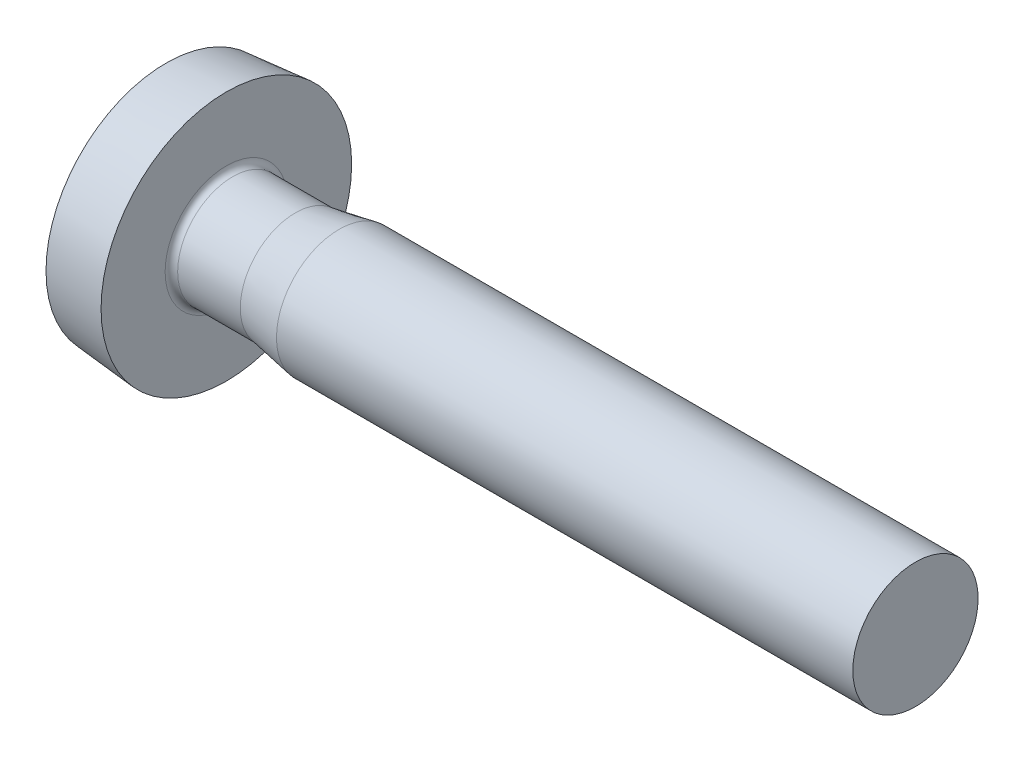
ISO-10303-21;
HEADER;
FILE_DESCRIPTION(('STEP AP214'),'2;1');
FILE_NAME('part.step','',(''),(''),'','','');
FILE_SCHEMA(('AUTOMOTIVE_DESIGN { 1 0 10303 214 1 1 1 1 }'));
ENDSEC;
DATA;
#1=APPLICATION_CONTEXT('core data for automotive mechanical design processes');
#2=APPLICATION_PROTOCOL_DEFINITION('international standard','automotive_design',2000,#1);
#3=PRODUCT_CONTEXT('',#1,'mechanical');
#4=PRODUCT('Part','Part','',(#3));
#5=PRODUCT_RELATED_PRODUCT_CATEGORY('part','',(#4));
#6=PRODUCT_DEFINITION_FORMATION('','',#4);
#7=PRODUCT_DEFINITION_CONTEXT('part definition',#1,'design');
#8=PRODUCT_DEFINITION('design','',#6,#7);
#9=PRODUCT_DEFINITION_SHAPE('','',#8);
#10=(LENGTH_UNIT() NAMED_UNIT(*) SI_UNIT(.MILLI.,.METRE.));
#11=(NAMED_UNIT(*) PLANE_ANGLE_UNIT() SI_UNIT($,.RADIAN.));
#12=(NAMED_UNIT(*) SI_UNIT($,.STERADIAN.) SOLID_ANGLE_UNIT());
#13=UNCERTAINTY_MEASURE_WITH_UNIT(LENGTH_MEASURE(1.E-05),#10,'distance_accuracy_value','');
#14=(GEOMETRIC_REPRESENTATION_CONTEXT(3) GLOBAL_UNCERTAINTY_ASSIGNED_CONTEXT((#13)) GLOBAL_UNIT_ASSIGNED_CONTEXT((#10,
#11,#12)) REPRESENTATION_CONTEXT('',''));
#15=CARTESIAN_POINT('',(0.,0.,0.));
#16=DIRECTION('',(0.,0.,1.));
#17=DIRECTION('',(1.,0.,0.));
#18=AXIS2_PLACEMENT_3D('',#15,#16,#17);
#19=CARTESIAN_POINT('',(1.59999999999987,0.,0.));
#20=DIRECTION('',(-1.,0.,0.));
#21=DIRECTION('',(0.,1.,0.));
#22=AXIS2_PLACEMENT_3D('',#19,#20,#21);
#23=SPHERICAL_SURFACE('',#22,3.19999999999987);
#24=CARTESIAN_POINT('',(-0.963195993658201,0.,0.));
#25=DIRECTION('',(-1.,0.,0.));
#26=DIRECTION('',(0.,0.,1.));
#27=AXIS2_PLACEMENT_3D('',#24,#25,#26);
#28=CIRCLE('',#27,1.9157312698013);
#29=CARTESIAN_POINT('',(-0.963195993658201,0.,1.9157312698013));
#30=VERTEX_POINT('',#29);
#31=EDGE_CURVE('E211',#30,#30,#28,.T.);
#32=ORIENTED_EDGE('',*,*,#31,.T.);
#33=EDGE_LOOP('',(#32));
#34=FACE_BOUND('',#33,.T.);
#35=CARTESIAN_POINT('',(1.59999999999987,0.153213036278402,-0.0134044037787443));
#36=DIRECTION('',(0.,-0.996194698091745,0.0871557427476639));
#37=DIRECTION('',(0.,-0.0871557427476639,-0.996194698091745));
#38=AXIS2_PLACEMENT_3D('',#35,#36,#37);
#39=CIRCLE('',#38,3.19630193934692);
#40=CARTESIAN_POINT('',(-1.44648875756993,0.2375,0.95));
#41=VERTEX_POINT('',#40);
#42=CARTESIAN_POINT('',(-1.57181248414002,0.18763146179022,0.38));
#43=VERTEX_POINT('',#42);
#44=EDGE_CURVE('E11',#41,#43,#39,.T.);
#45=ORIENTED_EDGE('',*,*,#44,.F.);
#46=CARTESIAN_POINT('',(1.59999999999987,0.,0.95));
#47=DIRECTION('',(0.,0.,-1.));
#48=DIRECTION('',(-1.,0.,0.));
#49=AXIS2_PLACEMENT_3D('',#46,#47,#48);
#50=CIRCLE('',#49,3.05573231811937);
#51=CARTESIAN_POINT('',(-1.44648875756992,-0.2375,0.95));
#52=VERTEX_POINT('',#51);
#53=EDGE_CURVE('E43',#52,#41,#50,.T.);
#54=ORIENTED_EDGE('',*,*,#53,.F.);
#55=CARTESIAN_POINT('',(1.59999999999987,-0.153213036278402,-0.0134044037787501));
#56=DIRECTION('',(0.,0.996194698091745,0.0871557427476639));
#57=DIRECTION('',(0.,-0.0871557427476639,0.996194698091745));
#58=AXIS2_PLACEMENT_3D('',#55,#56,#57);
#59=CIRCLE('',#58,3.19630193934691);
#60=CARTESIAN_POINT('',(-1.57181248414001,-0.18763146179022,0.38));
#61=VERTEX_POINT('',#60);
#62=EDGE_CURVE('E248',#61,#52,#59,.T.);
#63=ORIENTED_EDGE('',*,*,#62,.F.);
#64=CARTESIAN_POINT('',(1.59999999999987,-0.285633226163518,0.0999586768625951));
#65=DIRECTION('',(0.,0.943871701028256,-0.330312294651632));
#66=DIRECTION('',(0.,0.330312294651632,0.943871701028256));
#67=AXIS2_PLACEMENT_3D('',#64,#65,#66);
#68=CIRCLE('',#67,3.18565878948616);
#69=CARTESIAN_POINT('',(-1.58232422923875,-0.2375,0.2375));
#70=VERTEX_POINT('',#69);
#71=EDGE_CURVE('E246',#70,#61,#68,.T.);
#72=ORIENTED_EDGE('',*,*,#71,.F.);
#73=CARTESIAN_POINT('',(1.59999999999987,-0.0999586768625553,0.285633226163532));
#74=DIRECTION('',(0.,0.330312294651632,-0.943871701028256));
#75=DIRECTION('',(0.,0.943871701028256,0.330312294651632));
#76=AXIS2_PLACEMENT_3D('',#73,#74,#75);
#77=CIRCLE('',#76,3.18565878948616);
#78=CARTESIAN_POINT('',(-1.57181248414001,-0.38,0.18763146179022));
#79=VERTEX_POINT('',#78);
#80=EDGE_CURVE('E244',#79,#70,#77,.T.);
#81=ORIENTED_EDGE('',*,*,#80,.F.);
#82=CARTESIAN_POINT('',(1.59999999999987,0.01340440377878,0.153213036278399));
#83=DIRECTION('',(0.,-0.0871557427476639,-0.996194698091745));
#84=DIRECTION('',(0.,0.996194698091745,-0.0871557427476639));
#85=AXIS2_PLACEMENT_3D('',#82,#83,#84);
#86=CIRCLE('',#85,3.19630193934691);
#87=CARTESIAN_POINT('',(-1.44648875756992,-0.95,0.2375));
#88=VERTEX_POINT('',#87);
#89=EDGE_CURVE('E242',#88,#79,#86,.T.);
#90=ORIENTED_EDGE('',*,*,#89,.F.);
#91=CARTESIAN_POINT('',(1.59999999999987,-0.95,0.));
#92=DIRECTION('',(0.,1.,0.));
#93=DIRECTION('',(0.,0.,1.));
#94=AXIS2_PLACEMENT_3D('',#91,#92,#93);
#95=CIRCLE('',#94,3.05573231811936);
#96=CARTESIAN_POINT('',(-1.44648875756992,-0.95,-0.2375));
#97=VERTEX_POINT('',#96);
#98=EDGE_CURVE('E240',#97,#88,#95,.T.);
#99=ORIENTED_EDGE('',*,*,#98,.F.);
#100=CARTESIAN_POINT('',(1.59999999999987,0.01340440377878,-0.153213036278399));
#101=DIRECTION('',(0.,-0.0871557427476639,0.996194698091745));
#102=DIRECTION('',(0.,-0.996194698091745,-0.0871557427476639));
#103=AXIS2_PLACEMENT_3D('',#100,#101,#102);
#104=CIRCLE('',#103,3.19630193934691);
#105=CARTESIAN_POINT('',(-1.57181248414001,-0.38,-0.18763146179022));
#106=VERTEX_POINT('',#105);
#107=EDGE_CURVE('E238',#106,#97,#104,.T.);
#108=ORIENTED_EDGE('',*,*,#107,.F.);
#109=CARTESIAN_POINT('',(1.59999999999987,-0.0999586768625553,-0.285633226163532));
#110=DIRECTION('',(0.,0.330312294651632,0.943871701028256));
#111=DIRECTION('',(0.,-0.943871701028256,0.330312294651632));
#112=AXIS2_PLACEMENT_3D('',#109,#110,#111);
#113=CIRCLE('',#112,3.18565878948616);
#114=CARTESIAN_POINT('',(-1.58232422923875,-0.2375,-0.2375));
#115=VERTEX_POINT('',#114);
#116=EDGE_CURVE('E236',#115,#106,#113,.T.);
#117=ORIENTED_EDGE('',*,*,#116,.F.);
#118=CARTESIAN_POINT('',(1.59999999999987,-0.285633226163518,-0.0999586768625951));
#119=DIRECTION('',(0.,0.943871701028256,0.330312294651632));
#120=DIRECTION('',(0.,-0.330312294651632,0.943871701028256));
#121=AXIS2_PLACEMENT_3D('',#118,#119,#120);
#122=CIRCLE('',#121,3.18565878948616);
#123=CARTESIAN_POINT('',(-1.57181248414001,-0.18763146179022,-0.38));
#124=VERTEX_POINT('',#123);
#125=EDGE_CURVE('E234',#124,#115,#122,.T.);
#126=ORIENTED_EDGE('',*,*,#125,.F.);
#127=CARTESIAN_POINT('',(1.59999999999987,-0.153213036278402,0.0134044037787501));
#128=DIRECTION('',(0.,0.996194698091745,-0.0871557427476639));
#129=DIRECTION('',(0.,0.0871557427476639,0.996194698091745));
#130=AXIS2_PLACEMENT_3D('',#127,#128,#129);
#131=CIRCLE('',#130,3.19630193934691);
#132=CARTESIAN_POINT('',(-1.44648875756992,-0.2375,-0.95));
#133=VERTEX_POINT('',#132);
#134=EDGE_CURVE('E232',#133,#124,#131,.T.);
#135=ORIENTED_EDGE('',*,*,#134,.F.);
#136=CARTESIAN_POINT('',(1.59999999999987,0.,-0.95));
#137=DIRECTION('',(0.,0.,1.));
#138=DIRECTION('',(1.,0.,0.));
#139=AXIS2_PLACEMENT_3D('',#136,#137,#138);
#140=CIRCLE('',#139,3.05573231811937);
#141=CARTESIAN_POINT('',(-1.44648875756993,0.2375,-0.95));
#142=VERTEX_POINT('',#141);
#143=EDGE_CURVE('E230',#142,#133,#140,.T.);
#144=ORIENTED_EDGE('',*,*,#143,.F.);
#145=CARTESIAN_POINT('',(1.59999999999987,0.153213036278402,0.0134044037787443));
#146=DIRECTION('',(0.,-0.996194698091745,-0.0871557427476639));
#147=DIRECTION('',(0.,0.0871557427476639,-0.996194698091745));
#148=AXIS2_PLACEMENT_3D('',#145,#146,#147);
#149=CIRCLE('',#148,3.19630193934692);
#150=CARTESIAN_POINT('',(-1.57181248414002,0.18763146179022,-0.38));
#151=VERTEX_POINT('',#150);
#152=EDGE_CURVE('E228',#151,#142,#149,.T.);
#153=ORIENTED_EDGE('',*,*,#152,.F.);
#154=CARTESIAN_POINT('',(1.59999999999987,0.285633226163526,-0.0999586768625745));
#155=DIRECTION('',(0.,-0.943871701028256,0.330312294651632));
#156=DIRECTION('',(0.,-0.330312294651632,-0.943871701028256));
#157=AXIS2_PLACEMENT_3D('',#154,#155,#156);
#158=CIRCLE('',#157,3.18565878948617);
#159=CARTESIAN_POINT('',(-1.58232422923875,0.2375,-0.2375));
#160=VERTEX_POINT('',#159);
#161=EDGE_CURVE('E226',#160,#151,#158,.T.);
#162=ORIENTED_EDGE('',*,*,#161,.F.);
#163=CARTESIAN_POINT('',(1.59999999999987,0.0999586768626142,-0.285633226163512));
#164=DIRECTION('',(0.,-0.330312294651632,0.943871701028256));
#165=DIRECTION('',(0.,-0.943871701028256,-0.330312294651632));
#166=AXIS2_PLACEMENT_3D('',#163,#164,#165);
#167=CIRCLE('',#166,3.18565878948617);
#168=CARTESIAN_POINT('',(-1.57181248414002,0.38,-0.18763146179022));
#169=VERTEX_POINT('',#168);
#170=EDGE_CURVE('E224',#169,#160,#167,.T.);
#171=ORIENTED_EDGE('',*,*,#170,.F.);
#172=CARTESIAN_POINT('',(1.59999999999987,-0.0134044037787144,-0.153213036278405));
#173=DIRECTION('',(0.,0.0871557427476639,0.996194698091745));
#174=DIRECTION('',(0.,-0.996194698091745,0.0871557427476639));
#175=AXIS2_PLACEMENT_3D('',#172,#173,#174);
#176=CIRCLE('',#175,3.19630193934691);
#177=CARTESIAN_POINT('',(-1.44648875756994,0.95,-0.2375));
#178=VERTEX_POINT('',#177);
#179=EDGE_CURVE('E222',#178,#169,#176,.T.);
#180=ORIENTED_EDGE('',*,*,#179,.F.);
#181=CARTESIAN_POINT('',(1.59999999999987,0.95,0.));
#182=DIRECTION('',(0.,-1.,0.));
#183=DIRECTION('',(0.,0.,-1.));
#184=AXIS2_PLACEMENT_3D('',#181,#182,#183);
#185=CIRCLE('',#184,3.05573231811938);
#186=CARTESIAN_POINT('',(-1.44648875756994,0.95,0.2375));
#187=VERTEX_POINT('',#186);
#188=EDGE_CURVE('E220',#187,#178,#185,.T.);
#189=ORIENTED_EDGE('',*,*,#188,.F.);
#190=CARTESIAN_POINT('',(1.59999999999987,-0.0134044037787144,0.153213036278405));
#191=DIRECTION('',(0.,0.0871557427476639,-0.996194698091745));
#192=DIRECTION('',(0.,0.996194698091745,0.0871557427476639));
#193=AXIS2_PLACEMENT_3D('',#190,#191,#192);
#194=CIRCLE('',#193,3.19630193934691);
#195=CARTESIAN_POINT('',(-1.57181248414002,0.38,0.18763146179022));
#196=VERTEX_POINT('',#195);
#197=EDGE_CURVE('E218',#196,#187,#194,.T.);
#198=ORIENTED_EDGE('',*,*,#197,.F.);
#199=CARTESIAN_POINT('',(1.59999999999987,0.0999586768626142,0.285633226163512));
#200=DIRECTION('',(0.,-0.330312294651632,-0.943871701028256));
#201=DIRECTION('',(0.,0.943871701028256,-0.330312294651632));
#202=AXIS2_PLACEMENT_3D('',#199,#200,#201);
#203=CIRCLE('',#202,3.18565878948617);
#204=CARTESIAN_POINT('',(-1.58232422923875,0.2375,0.2375));
#205=VERTEX_POINT('',#204);
#206=EDGE_CURVE('E216',#205,#196,#203,.T.);
#207=ORIENTED_EDGE('',*,*,#206,.F.);
#208=CARTESIAN_POINT('',(1.59999999999987,0.285633226163526,0.0999586768625745));
#209=DIRECTION('',(0.,-0.943871701028256,-0.330312294651632));
#210=DIRECTION('',(0.,0.330312294651632,-0.943871701028256));
#211=AXIS2_PLACEMENT_3D('',#208,#209,#210);
#212=CIRCLE('',#211,3.18565878948617);
#213=EDGE_CURVE('E214',#43,#205,#212,.T.);
#214=ORIENTED_EDGE('',*,*,#213,.F.);
#215=EDGE_LOOP('',(#45,#54,#63,#72,#81,#90,#99,#108,#117,#126,#135,#144,#153,#162,#171,#180,
#189,#198,#207,#214));
#216=FACE_BOUND('',#215,.T.);
#217=ADVANCED_FACE('F36',(#34,#216),#23,.T.);
#218=CARTESIAN_POINT('',(11.,0.,0.));
#219=DIRECTION('',(-1.,0.,0.));
#220=DIRECTION('',(0.,0.,1.));
#221=AXIS2_PLACEMENT_3D('',#218,#219,#220);
#222=CYLINDRICAL_SURFACE('',#221,0.87725);
#223=CARTESIAN_POINT('',(0.1,0.,0.));
#224=DIRECTION('',(-1.,0.,0.));
#225=DIRECTION('',(0.,0.,1.));
#226=AXIS2_PLACEMENT_3D('',#223,#224,#225);
#227=CIRCLE('',#226,0.87725);
#228=CARTESIAN_POINT('',(0.1,0.,0.87725));
#229=VERTEX_POINT('',#228);
#230=EDGE_CURVE('E187',#229,#229,#227,.T.);
#231=ORIENTED_EDGE('',*,*,#230,.F.);
#232=EDGE_LOOP('',(#231));
#233=FACE_BOUND('',#232,.T.);
#234=CARTESIAN_POINT('',(1.1,0.,0.));
#235=DIRECTION('',(-1.,0.,0.));
#236=DIRECTION('',(0.,0.,1.));
#237=AXIS2_PLACEMENT_3D('',#234,#235,#236);
#238=CIRCLE('',#237,0.87725);
#239=CARTESIAN_POINT('',(1.1,0.,0.87725));
#240=VERTEX_POINT('',#239);
#241=EDGE_CURVE('E205',#240,#240,#238,.T.);
#242=ORIENTED_EDGE('',*,*,#241,.T.);
#243=EDGE_LOOP('',(#242));
#244=FACE_BOUND('',#243,.T.);
#245=ADVANCED_FACE('F428',(#233,#244),#222,.T.);
#246=CARTESIAN_POINT('',(1.8,0.,0.));
#247=DIRECTION('',(1.,0.,0.));
#248=DIRECTION('',(0.,0.,-1.));
#249=AXIS2_PLACEMENT_3D('',#246,#247,#248);
#250=CONICAL_SURFACE('',#249,1.,0.173592175789918);
#251=ORIENTED_EDGE('',*,*,#241,.F.);
#252=EDGE_LOOP('',(#251));
#253=FACE_BOUND('',#252,.T.);
#254=CARTESIAN_POINT('',(1.8,0.,0.));
#255=DIRECTION('',(-1.,0.,0.));
#256=DIRECTION('',(0.,0.,1.));
#257=AXIS2_PLACEMENT_3D('',#254,#255,#256);
#258=CIRCLE('',#257,1.);
#259=CARTESIAN_POINT('',(1.8,0.,1.));
#260=VERTEX_POINT('',#259);
#261=EDGE_CURVE('E202',#260,#260,#258,.T.);
#262=ORIENTED_EDGE('',*,*,#261,.T.);
#263=EDGE_LOOP('',(#262));
#264=FACE_BOUND('',#263,.T.);
#265=ADVANCED_FACE('F433',(#253,#264),#250,.T.);
#266=CARTESIAN_POINT('',(11.,0.,0.));
#267=DIRECTION('',(-1.,0.,0.));
#268=DIRECTION('',(0.,0.,1.));
#269=AXIS2_PLACEMENT_3D('',#266,#267,#268);
#270=CYLINDRICAL_SURFACE('',#269,1.);
#271=ORIENTED_EDGE('',*,*,#261,.F.);
#272=EDGE_LOOP('',(#271));
#273=FACE_BOUND('',#272,.T.);
#274=CARTESIAN_POINT('',(11.,0.,0.));
#275=DIRECTION('',(-1.,0.,0.));
#276=DIRECTION('',(0.,0.,1.));
#277=AXIS2_PLACEMENT_3D('',#274,#275,#276);
#278=CIRCLE('',#277,1.);
#279=CARTESIAN_POINT('',(11.,0.,1.));
#280=VERTEX_POINT('',#279);
#281=EDGE_CURVE('E199',#280,#280,#278,.T.);
#282=ORIENTED_EDGE('',*,*,#281,.T.);
#283=EDGE_LOOP('',(#282));
#284=FACE_BOUND('',#283,.T.);
#285=ADVANCED_FACE('F455',(#273,#284),#270,.T.);
#286=CARTESIAN_POINT('',(11.,1.,0.));
#287=DIRECTION('',(-1.,0.,0.));
#288=DIRECTION('',(0.,0.,1.));
#289=AXIS2_PLACEMENT_3D('',#286,#287,#288);
#290=PLANE('',#289);
#291=ORIENTED_EDGE('',*,*,#281,.F.);
#292=EDGE_LOOP('',(#291));
#293=FACE_BOUND('',#292,.T.);
#294=ADVANCED_FACE('F459',(#293),#290,.F.);
#295=CARTESIAN_POINT('',(0.100000000000008,0.,0.));
#296=DIRECTION('',(-1.,0.,0.));
#297=DIRECTION('',(0.,0.,1.));
#298=AXIS2_PLACEMENT_3D('',#295,#296,#297);
#299=TOROIDAL_SURFACE('',#298,0.977250000000008,0.100000000000008);
#300=CARTESIAN_POINT('',(0.,0.,0.));
#301=DIRECTION('',(-1.,0.,0.));
#302=DIRECTION('',(0.,0.,1.));
#303=AXIS2_PLACEMENT_3D('',#300,#301,#302);
#304=CIRCLE('',#303,0.977250000000008);
#305=CARTESIAN_POINT('',(0.,0.,0.977250000000008));
#306=VERTEX_POINT('',#305);
#307=EDGE_CURVE('E191',#306,#306,#304,.T.);
#308=ORIENTED_EDGE('',*,*,#307,.F.);
#309=EDGE_LOOP('',(#308));
#310=FACE_BOUND('',#309,.T.);
#311=ORIENTED_EDGE('',*,*,#230,.T.);
#312=EDGE_LOOP('',(#311));
#313=FACE_BOUND('',#312,.T.);
#314=ADVANCED_FACE('F442',(#310,#313),#299,.F.);
#315=CARTESIAN_POINT('',(0.,0.,0.));
#316=DIRECTION('',(1.,0.,0.));
#317=DIRECTION('',(0.,0.,-1.));
#318=AXIS2_PLACEMENT_3D('',#315,#316,#317);
#319=CONICAL_SURFACE('',#318,2.,0.0872664625997366);
#320=ORIENTED_EDGE('',*,*,#31,.F.);
#321=EDGE_LOOP('',(#320));
#322=FACE_BOUND('',#321,.T.);
#323=CARTESIAN_POINT('',(0.,0.,0.));
#324=DIRECTION('',(-1.,0.,0.));
#325=DIRECTION('',(0.,0.,1.));
#326=AXIS2_PLACEMENT_3D('',#323,#324,#325);
#327=CIRCLE('',#326,2.);
#328=CARTESIAN_POINT('',(0.,0.,2.));
#329=VERTEX_POINT('',#328);
#330=EDGE_CURVE('E208',#329,#329,#327,.T.);
#331=ORIENTED_EDGE('',*,*,#330,.T.);
#332=EDGE_LOOP('',(#331));
#333=FACE_BOUND('',#332,.T.);
#334=ADVANCED_FACE('F438',(#322,#333),#319,.T.);
#335=CARTESIAN_POINT('',(0.,2.,0.));
#336=DIRECTION('',(-1.,0.,0.));
#337=DIRECTION('',(0.,0.,1.));
#338=AXIS2_PLACEMENT_3D('',#335,#336,#337);
#339=PLANE('',#338);
#340=ORIENTED_EDGE('',*,*,#307,.T.);
#341=EDGE_LOOP('',(#340));
#342=FACE_BOUND('',#341,.T.);
#343=ORIENTED_EDGE('',*,*,#330,.F.);
#344=EDGE_LOOP('',(#343));
#345=FACE_BOUND('',#344,.T.);
#346=ADVANCED_FACE('F441',(#342,#345),#339,.F.);
#347=CARTESIAN_POINT('',(-0.8,0.18763146179022,0.38));
#348=DIRECTION('',(0.,-0.996194698091745,0.0871557427476639));
#349=DIRECTION('',(0.,-0.0871557427476639,-0.996194698091745));
#350=AXIS2_PLACEMENT_3D('',#347,#348,#349);
#351=PLANE('',#350);
#352=ORIENTED_EDGE('',*,*,#44,.T.);
#353=DIRECTION('',(-1.,0.,0.));
#354=VECTOR('',#353,1.);
#355=CARTESIAN_POINT('',(-0.8,0.18763146179022,0.38));
#356=LINE('',#355,#354);
#357=CARTESIAN_POINT('',(-0.8,0.18763146179022,0.38));
#358=VERTEX_POINT('',#357);
#359=EDGE_CURVE('E50',#358,#43,#356,.T.);
#360=ORIENTED_EDGE('',*,*,#359,.F.);
#361=DIRECTION('',(0.,0.0871557427476639,0.996194698091745));
#362=VECTOR('',#361,1.);
#363=CARTESIAN_POINT('',(-0.8,0.18763146179022,0.38));
#364=LINE('',#363,#362);
#365=CARTESIAN_POINT('',(-0.8,0.2375,0.95));
#366=VERTEX_POINT('',#365);
#367=EDGE_CURVE('E176',#358,#366,#364,.T.);
#368=ORIENTED_EDGE('',*,*,#367,.T.);
#369=DIRECTION('',(-1.,0.,0.));
#370=VECTOR('',#369,1.);
#371=CARTESIAN_POINT('',(-0.8,0.2375,0.95));
#372=LINE('',#371,#370);
#373=EDGE_CURVE('E183',#366,#41,#372,.T.);
#374=ORIENTED_EDGE('',*,*,#373,.T.);
#375=EDGE_LOOP('',(#352,#360,#368,#374));
#376=FACE_BOUND('',#375,.T.);
#377=ADVANCED_FACE('F182',(#376),#351,.T.);
#378=CARTESIAN_POINT('',(-0.8,0.2375,0.95));
#379=DIRECTION('',(0.,0.,-1.));
#380=DIRECTION('',(-1.,0.,0.));
#381=AXIS2_PLACEMENT_3D('',#378,#379,#380);
#382=PLANE('',#381);
#383=ORIENTED_EDGE('',*,*,#53,.T.);
#384=ORIENTED_EDGE('',*,*,#373,.F.);
#385=DIRECTION('',(0.,-1.,0.));
#386=VECTOR('',#385,1.);
#387=CARTESIAN_POINT('',(-0.8,0.2375,0.95));
#388=LINE('',#387,#386);
#389=CARTESIAN_POINT('',(-0.8,-0.2375,0.95));
#390=VERTEX_POINT('',#389);
#391=EDGE_CURVE('E172',#366,#390,#388,.T.);
#392=ORIENTED_EDGE('',*,*,#391,.T.);
#393=DIRECTION('',(-1.,0.,0.));
#394=VECTOR('',#393,1.);
#395=CARTESIAN_POINT('',(-0.8,-0.2375,0.95));
#396=LINE('',#395,#394);
#397=EDGE_CURVE('E188',#390,#52,#396,.T.);
#398=ORIENTED_EDGE('',*,*,#397,.T.);
#399=EDGE_LOOP('',(#383,#384,#392,#398));
#400=FACE_BOUND('',#399,.T.);
#401=ADVANCED_FACE('F186',(#400),#382,.T.);
#402=CARTESIAN_POINT('',(-0.8,-0.2375,0.95));
#403=DIRECTION('',(0.,0.996194698091745,0.0871557427476639));
#404=DIRECTION('',(0.,-0.0871557427476639,0.996194698091745));
#405=AXIS2_PLACEMENT_3D('',#402,#403,#404);
#406=PLANE('',#405);
#407=ORIENTED_EDGE('',*,*,#62,.T.);
#408=ORIENTED_EDGE('',*,*,#397,.F.);
#409=DIRECTION('',(0.,0.0871557427476639,-0.996194698091745));
#410=VECTOR('',#409,1.);
#411=CARTESIAN_POINT('',(-0.8,-0.2375,0.95));
#412=LINE('',#411,#410);
#413=CARTESIAN_POINT('',(-0.8,-0.18763146179022,0.38));
#414=VERTEX_POINT('',#413);
#415=EDGE_CURVE('E178',#390,#414,#412,.T.);
#416=ORIENTED_EDGE('',*,*,#415,.T.);
#417=DIRECTION('',(-1.,0.,0.));
#418=VECTOR('',#417,1.);
#419=CARTESIAN_POINT('',(-0.8,-0.18763146179022,0.38));
#420=LINE('',#419,#418);
#421=EDGE_CURVE('E193',#414,#61,#420,.T.);
#422=ORIENTED_EDGE('',*,*,#421,.T.);
#423=EDGE_LOOP('',(#407,#408,#416,#422));
#424=FACE_BOUND('',#423,.T.);
#425=ADVANCED_FACE('F252',(#424),#406,.T.);
#426=CARTESIAN_POINT('',(-0.8,-0.18763146179022,0.38));
#427=DIRECTION('',(0.,0.943871701028256,-0.330312294651632));
#428=DIRECTION('',(0.,0.330312294651632,0.943871701028256));
#429=AXIS2_PLACEMENT_3D('',#426,#427,#428);
#430=PLANE('',#429);
#431=ORIENTED_EDGE('',*,*,#71,.T.);
#432=ORIENTED_EDGE('',*,*,#421,.F.);
#433=DIRECTION('',(0.,-0.330312294651632,-0.943871701028256));
#434=VECTOR('',#433,1.);
#435=CARTESIAN_POINT('',(-0.8,-0.18763146179022,0.38));
#436=LINE('',#435,#434);
#437=CARTESIAN_POINT('',(-0.8,-0.2375,0.2375));
#438=VERTEX_POINT('',#437);
#439=EDGE_CURVE('E320',#414,#438,#436,.T.);
#440=ORIENTED_EDGE('',*,*,#439,.T.);
#441=DIRECTION('',(-1.,0.,0.));
#442=VECTOR('',#441,1.);
#443=CARTESIAN_POINT('',(-0.8,-0.2375,0.2375));
#444=LINE('',#443,#442);
#445=EDGE_CURVE('E315',#438,#70,#444,.T.);
#446=ORIENTED_EDGE('',*,*,#445,.T.);
#447=EDGE_LOOP('',(#431,#432,#440,#446));
#448=FACE_BOUND('',#447,.T.);
#449=ADVANCED_FACE('F319',(#448),#430,.T.);
#450=CARTESIAN_POINT('',(-0.8,-0.2375,0.2375));
#451=DIRECTION('',(0.,0.330312294651632,-0.943871701028256));
#452=DIRECTION('',(0.,0.943871701028256,0.330312294651632));
#453=AXIS2_PLACEMENT_3D('',#450,#451,#452);
#454=PLANE('',#453);
#455=ORIENTED_EDGE('',*,*,#80,.T.);
#456=ORIENTED_EDGE('',*,*,#445,.F.);
#457=DIRECTION('',(0.,-0.943871701028256,-0.330312294651632));
#458=VECTOR('',#457,1.);
#459=CARTESIAN_POINT('',(-0.8,-0.2375,0.2375));
#460=LINE('',#459,#458);
#461=CARTESIAN_POINT('',(-0.8,-0.38,0.18763146179022));
#462=VERTEX_POINT('',#461);
#463=EDGE_CURVE('E328',#438,#462,#460,.T.);
#464=ORIENTED_EDGE('',*,*,#463,.T.);
#465=DIRECTION('',(-1.,0.,0.));
#466=VECTOR('',#465,1.);
#467=CARTESIAN_POINT('',(-0.8,-0.38,0.18763146179022));
#468=LINE('',#467,#466);
#469=EDGE_CURVE('E312',#462,#79,#468,.T.);
#470=ORIENTED_EDGE('',*,*,#469,.T.);
#471=EDGE_LOOP('',(#455,#456,#464,#470));
#472=FACE_BOUND('',#471,.T.);
#473=ADVANCED_FACE('F326',(#472),#454,.T.);
#474=CARTESIAN_POINT('',(-0.8,-0.38,0.18763146179022));
#475=DIRECTION('',(0.,-0.0871557427476639,-0.996194698091745));
#476=DIRECTION('',(0.,0.996194698091745,-0.0871557427476639));
#477=AXIS2_PLACEMENT_3D('',#474,#475,#476);
#478=PLANE('',#477);
#479=ORIENTED_EDGE('',*,*,#89,.T.);
#480=ORIENTED_EDGE('',*,*,#469,.F.);
#481=DIRECTION('',(0.,-0.996194698091745,0.0871557427476639));
#482=VECTOR('',#481,1.);
#483=CARTESIAN_POINT('',(-0.8,-0.38,0.18763146179022));
#484=LINE('',#483,#482);
#485=CARTESIAN_POINT('',(-0.8,-0.95,0.2375));
#486=VERTEX_POINT('',#485);
#487=EDGE_CURVE('E332',#462,#486,#484,.T.);
#488=ORIENTED_EDGE('',*,*,#487,.T.);
#489=DIRECTION('',(-1.,0.,0.));
#490=VECTOR('',#489,1.);
#491=CARTESIAN_POINT('',(-0.8,-0.95,0.2375));
#492=LINE('',#491,#490);
#493=EDGE_CURVE('E309',#486,#88,#492,.T.);
#494=ORIENTED_EDGE('',*,*,#493,.T.);
#495=EDGE_LOOP('',(#479,#480,#488,#494));
#496=FACE_BOUND('',#495,.T.);
#497=ADVANCED_FACE('F331',(#496),#478,.T.);
#498=CARTESIAN_POINT('',(-0.8,-0.95,0.2375));
#499=DIRECTION('',(0.,1.,0.));
#500=DIRECTION('',(0.,0.,1.));
#501=AXIS2_PLACEMENT_3D('',#498,#499,#500);
#502=PLANE('',#501);
#503=ORIENTED_EDGE('',*,*,#98,.T.);
#504=ORIENTED_EDGE('',*,*,#493,.F.);
#505=DIRECTION('',(0.,0.,-1.));
#506=VECTOR('',#505,1.);
#507=CARTESIAN_POINT('',(-0.8,-0.95,0.2375));
#508=LINE('',#507,#506);
#509=CARTESIAN_POINT('',(-0.8,-0.95,-0.2375));
#510=VERTEX_POINT('',#509);
#511=EDGE_CURVE('E336',#486,#510,#508,.T.);
#512=ORIENTED_EDGE('',*,*,#511,.T.);
#513=DIRECTION('',(-1.,0.,0.));
#514=VECTOR('',#513,1.);
#515=CARTESIAN_POINT('',(-0.8,-0.95,-0.2375));
#516=LINE('',#515,#514);
#517=EDGE_CURVE('E306',#510,#97,#516,.T.);
#518=ORIENTED_EDGE('',*,*,#517,.T.);
#519=EDGE_LOOP('',(#503,#504,#512,#518));
#520=FACE_BOUND('',#519,.T.);
#521=ADVANCED_FACE('F418',(#520),#502,.T.);
#522=CARTESIAN_POINT('',(-0.8,-0.95,-0.2375));
#523=DIRECTION('',(0.,-0.0871557427476639,0.996194698091745));
#524=DIRECTION('',(0.,-0.996194698091745,-0.0871557427476639));
#525=AXIS2_PLACEMENT_3D('',#522,#523,#524);
#526=PLANE('',#525);
#527=ORIENTED_EDGE('',*,*,#107,.T.);
#528=ORIENTED_EDGE('',*,*,#517,.F.);
#529=DIRECTION('',(0.,0.996194698091745,0.0871557427476639));
#530=VECTOR('',#529,1.);
#531=CARTESIAN_POINT('',(-0.8,-0.95,-0.2375));
#532=LINE('',#531,#530);
#533=CARTESIAN_POINT('',(-0.8,-0.38,-0.18763146179022));
#534=VERTEX_POINT('',#533);
#535=EDGE_CURVE('E338',#510,#534,#532,.T.);
#536=ORIENTED_EDGE('',*,*,#535,.T.);
#537=DIRECTION('',(-1.,0.,0.));
#538=VECTOR('',#537,1.);
#539=CARTESIAN_POINT('',(-0.8,-0.38,-0.18763146179022));
#540=LINE('',#539,#538);
#541=EDGE_CURVE('E303',#534,#106,#540,.T.);
#542=ORIENTED_EDGE('',*,*,#541,.T.);
#543=EDGE_LOOP('',(#527,#528,#536,#542));
#544=FACE_BOUND('',#543,.T.);
#545=ADVANCED_FACE('F416',(#544),#526,.T.);
#546=CARTESIAN_POINT('',(-0.8,-0.38,-0.18763146179022));
#547=DIRECTION('',(0.,0.330312294651632,0.943871701028256));
#548=DIRECTION('',(0.,-0.943871701028256,0.330312294651632));
#549=AXIS2_PLACEMENT_3D('',#546,#547,#548);
#550=PLANE('',#549);
#551=ORIENTED_EDGE('',*,*,#116,.T.);
#552=ORIENTED_EDGE('',*,*,#541,.F.);
#553=DIRECTION('',(0.,0.943871701028256,-0.330312294651632));
#554=VECTOR('',#553,1.);
#555=CARTESIAN_POINT('',(-0.8,-0.38,-0.18763146179022));
#556=LINE('',#555,#554);
#557=CARTESIAN_POINT('',(-0.8,-0.2375,-0.2375));
#558=VERTEX_POINT('',#557);
#559=EDGE_CURVE('E344',#534,#558,#556,.T.);
#560=ORIENTED_EDGE('',*,*,#559,.T.);
#561=DIRECTION('',(-1.,0.,0.));
#562=VECTOR('',#561,1.);
#563=CARTESIAN_POINT('',(-0.8,-0.2375,-0.2375));
#564=LINE('',#563,#562);
#565=EDGE_CURVE('E300',#558,#115,#564,.T.);
#566=ORIENTED_EDGE('',*,*,#565,.T.);
#567=EDGE_LOOP('',(#551,#552,#560,#566));
#568=FACE_BOUND('',#567,.T.);
#569=ADVANCED_FACE('F411',(#568),#550,.T.);
#570=CARTESIAN_POINT('',(-0.8,-0.2375,-0.2375));
#571=DIRECTION('',(0.,0.943871701028256,0.330312294651632));
#572=DIRECTION('',(0.,-0.330312294651632,0.943871701028256));
#573=AXIS2_PLACEMENT_3D('',#570,#571,#572);
#574=PLANE('',#573);
#575=ORIENTED_EDGE('',*,*,#125,.T.);
#576=ORIENTED_EDGE('',*,*,#565,.F.);
#577=DIRECTION('',(0.,0.330312294651632,-0.943871701028256));
#578=VECTOR('',#577,1.);
#579=CARTESIAN_POINT('',(-0.8,-0.2375,-0.2375));
#580=LINE('',#579,#578);
#581=CARTESIAN_POINT('',(-0.8,-0.18763146179022,-0.38));
#582=VERTEX_POINT('',#581);
#583=EDGE_CURVE('E346',#558,#582,#580,.T.);
#584=ORIENTED_EDGE('',*,*,#583,.T.);
#585=DIRECTION('',(-1.,0.,0.));
#586=VECTOR('',#585,1.);
#587=CARTESIAN_POINT('',(-0.8,-0.18763146179022,-0.38));
#588=LINE('',#587,#586);
#589=EDGE_CURVE('E297',#582,#124,#588,.T.);
#590=ORIENTED_EDGE('',*,*,#589,.T.);
#591=EDGE_LOOP('',(#575,#576,#584,#590));
#592=FACE_BOUND('',#591,.T.);
#593=ADVANCED_FACE('F408',(#592),#574,.T.);
#594=CARTESIAN_POINT('',(-0.8,-0.18763146179022,-0.38));
#595=DIRECTION('',(0.,0.996194698091745,-0.0871557427476639));
#596=DIRECTION('',(0.,0.0871557427476639,0.996194698091745));
#597=AXIS2_PLACEMENT_3D('',#594,#595,#596);
#598=PLANE('',#597);
#599=ORIENTED_EDGE('',*,*,#134,.T.);
#600=ORIENTED_EDGE('',*,*,#589,.F.);
#601=DIRECTION('',(0.,-0.0871557427476639,-0.996194698091745));
#602=VECTOR('',#601,1.);
#603=CARTESIAN_POINT('',(-0.8,-0.18763146179022,-0.38));
#604=LINE('',#603,#602);
#605=CARTESIAN_POINT('',(-0.8,-0.2375,-0.95));
#606=VERTEX_POINT('',#605);
#607=EDGE_CURVE('E348',#582,#606,#604,.T.);
#608=ORIENTED_EDGE('',*,*,#607,.T.);
#609=DIRECTION('',(-1.,0.,0.));
#610=VECTOR('',#609,1.);
#611=CARTESIAN_POINT('',(-0.8,-0.2375,-0.95));
#612=LINE('',#611,#610);
#613=EDGE_CURVE('E294',#606,#133,#612,.T.);
#614=ORIENTED_EDGE('',*,*,#613,.T.);
#615=EDGE_LOOP('',(#599,#600,#608,#614));
#616=FACE_BOUND('',#615,.T.);
#617=ADVANCED_FACE('F401',(#616),#598,.T.);
#618=CARTESIAN_POINT('',(-0.8,-0.2375,-0.95));
#619=DIRECTION('',(0.,0.,1.));
#620=DIRECTION('',(1.,0.,0.));
#621=AXIS2_PLACEMENT_3D('',#618,#619,#620);
#622=PLANE('',#621);
#623=ORIENTED_EDGE('',*,*,#143,.T.);
#624=ORIENTED_EDGE('',*,*,#613,.F.);
#625=DIRECTION('',(0.,1.,0.));
#626=VECTOR('',#625,1.);
#627=CARTESIAN_POINT('',(-0.8,-0.2375,-0.95));
#628=LINE('',#627,#626);
#629=CARTESIAN_POINT('',(-0.8,0.2375,-0.95));
#630=VERTEX_POINT('',#629);
#631=EDGE_CURVE('E350',#606,#630,#628,.T.);
#632=ORIENTED_EDGE('',*,*,#631,.T.);
#633=DIRECTION('',(-1.,0.,0.));
#634=VECTOR('',#633,1.);
#635=CARTESIAN_POINT('',(-0.8,0.2375,-0.95));
#636=LINE('',#635,#634);
#637=EDGE_CURVE('E291',#630,#142,#636,.T.);
#638=ORIENTED_EDGE('',*,*,#637,.T.);
#639=EDGE_LOOP('',(#623,#624,#632,#638));
#640=FACE_BOUND('',#639,.T.);
#641=ADVANCED_FACE('F399',(#640),#622,.T.);
#642=CARTESIAN_POINT('',(-0.8,0.2375,-0.95));
#643=DIRECTION('',(0.,-0.996194698091745,-0.0871557427476639));
#644=DIRECTION('',(0.,0.0871557427476639,-0.996194698091745));
#645=AXIS2_PLACEMENT_3D('',#642,#643,#644);
#646=PLANE('',#645);
#647=ORIENTED_EDGE('',*,*,#152,.T.);
#648=ORIENTED_EDGE('',*,*,#637,.F.);
#649=DIRECTION('',(0.,-0.0871557427476639,0.996194698091745));
#650=VECTOR('',#649,1.);
#651=CARTESIAN_POINT('',(-0.8,0.2375,-0.95));
#652=LINE('',#651,#650);
#653=CARTESIAN_POINT('',(-0.8,0.18763146179022,-0.38));
#654=VERTEX_POINT('',#653);
#655=EDGE_CURVE('E352',#630,#654,#652,.T.);
#656=ORIENTED_EDGE('',*,*,#655,.T.);
#657=DIRECTION('',(-1.,0.,0.));
#658=VECTOR('',#657,1.);
#659=CARTESIAN_POINT('',(-0.8,0.18763146179022,-0.38));
#660=LINE('',#659,#658);
#661=EDGE_CURVE('E288',#654,#151,#660,.T.);
#662=ORIENTED_EDGE('',*,*,#661,.T.);
#663=EDGE_LOOP('',(#647,#648,#656,#662));
#664=FACE_BOUND('',#663,.T.);
#665=ADVANCED_FACE('F392',(#664),#646,.T.);
#666=CARTESIAN_POINT('',(-0.8,0.18763146179022,-0.38));
#667=DIRECTION('',(0.,-0.943871701028256,0.330312294651632));
#668=DIRECTION('',(0.,-0.330312294651632,-0.943871701028256));
#669=AXIS2_PLACEMENT_3D('',#666,#667,#668);
#670=PLANE('',#669);
#671=ORIENTED_EDGE('',*,*,#161,.T.);
#672=ORIENTED_EDGE('',*,*,#661,.F.);
#673=DIRECTION('',(0.,0.330312294651632,0.943871701028256));
#674=VECTOR('',#673,1.);
#675=CARTESIAN_POINT('',(-0.8,0.18763146179022,-0.38));
#676=LINE('',#675,#674);
#677=CARTESIAN_POINT('',(-0.8,0.2375,-0.2375));
#678=VERTEX_POINT('',#677);
#679=EDGE_CURVE('E354',#654,#678,#676,.T.);
#680=ORIENTED_EDGE('',*,*,#679,.T.);
#681=DIRECTION('',(-1.,0.,0.));
#682=VECTOR('',#681,1.);
#683=CARTESIAN_POINT('',(-0.8,0.2375,-0.2375));
#684=LINE('',#683,#682);
#685=EDGE_CURVE('E285',#678,#160,#684,.T.);
#686=ORIENTED_EDGE('',*,*,#685,.T.);
#687=EDGE_LOOP('',(#671,#672,#680,#686));
#688=FACE_BOUND('',#687,.T.);
#689=ADVANCED_FACE('F389',(#688),#670,.T.);
#690=CARTESIAN_POINT('',(-0.8,0.2375,-0.2375));
#691=DIRECTION('',(0.,-0.330312294651632,0.943871701028256));
#692=DIRECTION('',(0.,-0.943871701028256,-0.330312294651632));
#693=AXIS2_PLACEMENT_3D('',#690,#691,#692);
#694=PLANE('',#693);
#695=ORIENTED_EDGE('',*,*,#170,.T.);
#696=ORIENTED_EDGE('',*,*,#685,.F.);
#697=DIRECTION('',(0.,0.943871701028256,0.330312294651632));
#698=VECTOR('',#697,1.);
#699=CARTESIAN_POINT('',(-0.8,0.2375,-0.2375));
#700=LINE('',#699,#698);
#701=CARTESIAN_POINT('',(-0.8,0.38,-0.18763146179022));
#702=VERTEX_POINT('',#701);
#703=EDGE_CURVE('E356',#678,#702,#700,.T.);
#704=ORIENTED_EDGE('',*,*,#703,.T.);
#705=DIRECTION('',(-1.,0.,0.));
#706=VECTOR('',#705,1.);
#707=CARTESIAN_POINT('',(-0.8,0.38,-0.18763146179022));
#708=LINE('',#707,#706);
#709=EDGE_CURVE('E282',#702,#169,#708,.T.);
#710=ORIENTED_EDGE('',*,*,#709,.T.);
#711=EDGE_LOOP('',(#695,#696,#704,#710));
#712=FACE_BOUND('',#711,.T.);
#713=ADVANCED_FACE('F381',(#712),#694,.T.);
#714=CARTESIAN_POINT('',(-0.8,0.38,-0.18763146179022));
#715=DIRECTION('',(0.,0.0871557427476639,0.996194698091745));
#716=DIRECTION('',(0.,-0.996194698091745,0.0871557427476639));
#717=AXIS2_PLACEMENT_3D('',#714,#715,#716);
#718=PLANE('',#717);
#719=ORIENTED_EDGE('',*,*,#179,.T.);
#720=ORIENTED_EDGE('',*,*,#709,.F.);
#721=DIRECTION('',(0.,0.996194698091745,-0.0871557427476639));
#722=VECTOR('',#721,1.);
#723=CARTESIAN_POINT('',(-0.8,0.38,-0.18763146179022));
#724=LINE('',#723,#722);
#725=CARTESIAN_POINT('',(-0.8,0.95,-0.2375));
#726=VERTEX_POINT('',#725);
#727=EDGE_CURVE('E358',#702,#726,#724,.T.);
#728=ORIENTED_EDGE('',*,*,#727,.T.);
#729=DIRECTION('',(-1.,0.,0.));
#730=VECTOR('',#729,1.);
#731=CARTESIAN_POINT('',(-0.8,0.95,-0.2375));
#732=LINE('',#731,#730);
#733=EDGE_CURVE('E279',#726,#178,#732,.T.);
#734=ORIENTED_EDGE('',*,*,#733,.T.);
#735=EDGE_LOOP('',(#719,#720,#728,#734));
#736=FACE_BOUND('',#735,.T.);
#737=ADVANCED_FACE('F379',(#736),#718,.T.);
#738=CARTESIAN_POINT('',(-0.8,0.95,-0.2375));
#739=DIRECTION('',(0.,-1.,0.));
#740=DIRECTION('',(0.,0.,-1.));
#741=AXIS2_PLACEMENT_3D('',#738,#739,#740);
#742=PLANE('',#741);
#743=ORIENTED_EDGE('',*,*,#188,.T.);
#744=ORIENTED_EDGE('',*,*,#733,.F.);
#745=DIRECTION('',(0.,0.,1.));
#746=VECTOR('',#745,1.);
#747=CARTESIAN_POINT('',(-0.8,0.95,-0.2375));
#748=LINE('',#747,#746);
#749=CARTESIAN_POINT('',(-0.8,0.95,0.2375));
#750=VERTEX_POINT('',#749);
#751=EDGE_CURVE('E360',#726,#750,#748,.T.);
#752=ORIENTED_EDGE('',*,*,#751,.T.);
#753=DIRECTION('',(-1.,0.,0.));
#754=VECTOR('',#753,1.);
#755=CARTESIAN_POINT('',(-0.8,0.95,0.2375));
#756=LINE('',#755,#754);
#757=EDGE_CURVE('E271',#750,#187,#756,.T.);
#758=ORIENTED_EDGE('',*,*,#757,.T.);
#759=EDGE_LOOP('',(#743,#744,#752,#758));
#760=FACE_BOUND('',#759,.T.);
#761=ADVANCED_FACE('F372',(#760),#742,.T.);
#762=CARTESIAN_POINT('',(-0.8,0.95,0.2375));
#763=DIRECTION('',(0.,0.0871557427476639,-0.996194698091745));
#764=DIRECTION('',(0.,0.996194698091745,0.0871557427476639));
#765=AXIS2_PLACEMENT_3D('',#762,#763,#764);
#766=PLANE('',#765);
#767=ORIENTED_EDGE('',*,*,#197,.T.);
#768=ORIENTED_EDGE('',*,*,#757,.F.);
#769=DIRECTION('',(0.,-0.996194698091745,-0.0871557427476639));
#770=VECTOR('',#769,1.);
#771=CARTESIAN_POINT('',(-0.8,0.95,0.2375));
#772=LINE('',#771,#770);
#773=CARTESIAN_POINT('',(-0.8,0.38,0.18763146179022));
#774=VERTEX_POINT('',#773);
#775=EDGE_CURVE('E362',#750,#774,#772,.T.);
#776=ORIENTED_EDGE('',*,*,#775,.T.);
#777=DIRECTION('',(-1.,0.,0.));
#778=VECTOR('',#777,1.);
#779=CARTESIAN_POINT('',(-0.8,0.38,0.18763146179022));
#780=LINE('',#779,#778);
#781=EDGE_CURVE('E269',#774,#196,#780,.T.);
#782=ORIENTED_EDGE('',*,*,#781,.T.);
#783=EDGE_LOOP('',(#767,#768,#776,#782));
#784=FACE_BOUND('',#783,.T.);
#785=ADVANCED_FACE('F369',(#784),#766,.T.);
#786=CARTESIAN_POINT('',(-0.8,0.38,0.18763146179022));
#787=DIRECTION('',(0.,-0.330312294651632,-0.943871701028256));
#788=DIRECTION('',(0.,0.943871701028256,-0.330312294651632));
#789=AXIS2_PLACEMENT_3D('',#786,#787,#788);
#790=PLANE('',#789);
#791=ORIENTED_EDGE('',*,*,#206,.T.);
#792=ORIENTED_EDGE('',*,*,#781,.F.);
#793=DIRECTION('',(0.,-0.943871701028256,0.330312294651632));
#794=VECTOR('',#793,1.);
#795=CARTESIAN_POINT('',(-0.8,0.38,0.18763146179022));
#796=LINE('',#795,#794);
#797=CARTESIAN_POINT('',(-0.8,0.2375,0.2375));
#798=VERTEX_POINT('',#797);
#799=EDGE_CURVE('E268',#774,#798,#796,.T.);
#800=ORIENTED_EDGE('',*,*,#799,.T.);
#801=DIRECTION('',(-1.,0.,0.));
#802=VECTOR('',#801,1.);
#803=CARTESIAN_POINT('',(-0.8,0.2375,0.2375));
#804=LINE('',#803,#802);
#805=EDGE_CURVE('E262',#798,#205,#804,.T.);
#806=ORIENTED_EDGE('',*,*,#805,.T.);
#807=EDGE_LOOP('',(#791,#792,#800,#806));
#808=FACE_BOUND('',#807,.T.);
#809=ADVANCED_FACE('F264',(#808),#790,.T.);
#810=CARTESIAN_POINT('',(-0.8,0.2375,0.2375));
#811=DIRECTION('',(0.,-0.943871701028256,-0.330312294651632));
#812=DIRECTION('',(0.,0.330312294651632,-0.943871701028256));
#813=AXIS2_PLACEMENT_3D('',#810,#811,#812);
#814=PLANE('',#813);
#815=ORIENTED_EDGE('',*,*,#213,.T.);
#816=ORIENTED_EDGE('',*,*,#805,.F.);
#817=DIRECTION('',(0.,-0.330312294651632,0.943871701028256));
#818=VECTOR('',#817,1.);
#819=CARTESIAN_POINT('',(-0.8,0.2375,0.2375));
#820=LINE('',#819,#818);
#821=EDGE_CURVE('E273',#798,#358,#820,.T.);
#822=ORIENTED_EDGE('',*,*,#821,.T.);
#823=ORIENTED_EDGE('',*,*,#359,.T.);
#824=EDGE_LOOP('',(#815,#816,#822,#823));
#825=FACE_BOUND('',#824,.T.);
#826=ADVANCED_FACE('F261',(#825),#814,.T.);
#827=CARTESIAN_POINT('',(-0.8,0.,0.));
#828=DIRECTION('',(1.,0.,0.));
#829=DIRECTION('',(0.,0.,-1.));
#830=AXIS2_PLACEMENT_3D('',#827,#828,#829);
#831=PLANE('',#830);
#832=ORIENTED_EDGE('',*,*,#367,.F.);
#833=ORIENTED_EDGE('',*,*,#821,.F.);
#834=ORIENTED_EDGE('',*,*,#799,.F.);
#835=ORIENTED_EDGE('',*,*,#775,.F.);
#836=ORIENTED_EDGE('',*,*,#751,.F.);
#837=ORIENTED_EDGE('',*,*,#727,.F.);
#838=ORIENTED_EDGE('',*,*,#703,.F.);
#839=ORIENTED_EDGE('',*,*,#679,.F.);
#840=ORIENTED_EDGE('',*,*,#655,.F.);
#841=ORIENTED_EDGE('',*,*,#631,.F.);
#842=ORIENTED_EDGE('',*,*,#607,.F.);
#843=ORIENTED_EDGE('',*,*,#583,.F.);
#844=ORIENTED_EDGE('',*,*,#559,.F.);
#845=ORIENTED_EDGE('',*,*,#535,.F.);
#846=ORIENTED_EDGE('',*,*,#511,.F.);
#847=ORIENTED_EDGE('',*,*,#487,.F.);
#848=ORIENTED_EDGE('',*,*,#463,.F.);
#849=ORIENTED_EDGE('',*,*,#439,.F.);
#850=ORIENTED_EDGE('',*,*,#415,.F.);
#851=ORIENTED_EDGE('',*,*,#391,.F.);
#852=EDGE_LOOP('',(#832,#833,#834,#835,#836,#837,#838,#839,#840,#841,#842,#843,#844,#845,#846,
#847,#848,#849,#850,#851));
#853=FACE_BOUND('',#852,.T.);
#854=ADVANCED_FACE('F174',(#853),#831,.F.);
#855=CLOSED_SHELL('',(#217,#245,#265,#285,#294,#314,#334,#346,#377,#401,#425,#449,#473,#497,
#521,#545,#569,#593,#617,#641,#665,#689,#713,#737,#761,#785,#809,#826,#854));
#856=MANIFOLD_SOLID_BREP('B2',#855);
#857=ADVANCED_BREP_SHAPE_REPRESENTATION('',(#18,#856),#14);
#858=SHAPE_DEFINITION_REPRESENTATION(#9,#857);
ENDSEC;
END-ISO-10303-21;
